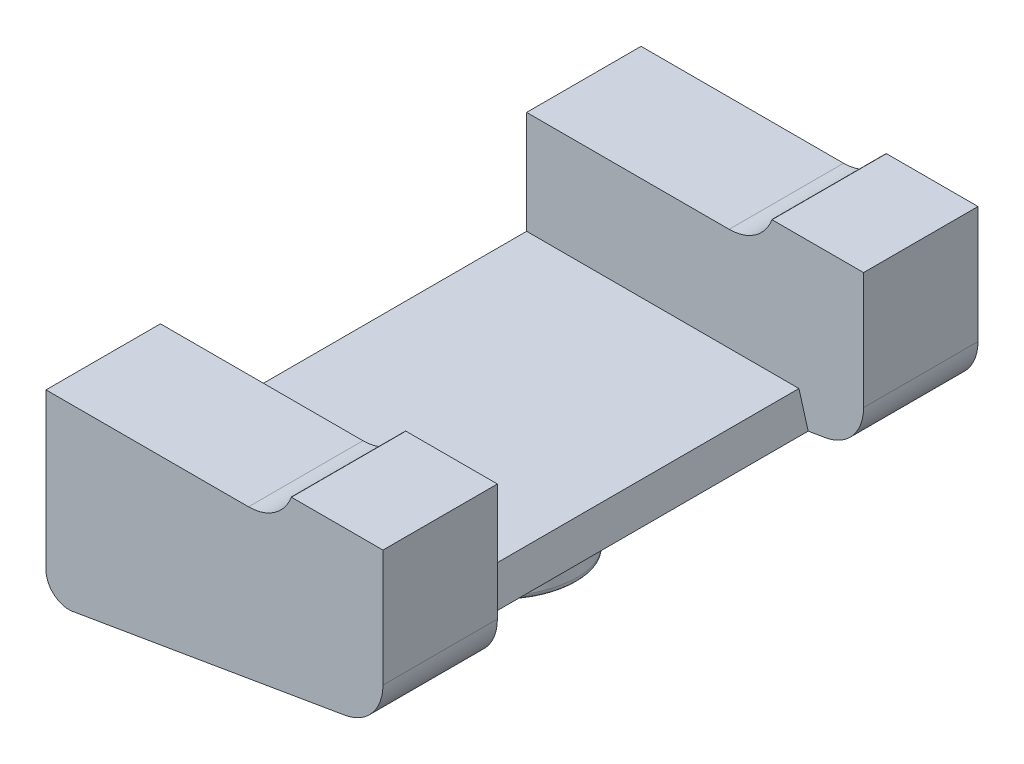
ISO-10303-21;
HEADER;
FILE_DESCRIPTION(('STEP AP214'),'2;1');
FILE_NAME('part.step','',(''),(''),'','','');
FILE_SCHEMA(('AUTOMOTIVE_DESIGN { 1 0 10303 214 1 1 1 1 }'));
ENDSEC;
DATA;
#1=APPLICATION_CONTEXT('core data for automotive mechanical design processes');
#2=APPLICATION_PROTOCOL_DEFINITION('international standard','automotive_design',2000,#1);
#3=PRODUCT_CONTEXT('',#1,'mechanical');
#4=PRODUCT('Part','Part','',(#3));
#5=PRODUCT_RELATED_PRODUCT_CATEGORY('part','',(#4));
#6=PRODUCT_DEFINITION_FORMATION('','',#4);
#7=PRODUCT_DEFINITION_CONTEXT('part definition',#1,'design');
#8=PRODUCT_DEFINITION('design','',#6,#7);
#9=PRODUCT_DEFINITION_SHAPE('','',#8);
#10=(LENGTH_UNIT() NAMED_UNIT(*) SI_UNIT(.MILLI.,.METRE.));
#11=(NAMED_UNIT(*) PLANE_ANGLE_UNIT() SI_UNIT($,.RADIAN.));
#12=(NAMED_UNIT(*) SI_UNIT($,.STERADIAN.) SOLID_ANGLE_UNIT());
#13=UNCERTAINTY_MEASURE_WITH_UNIT(LENGTH_MEASURE(1.E-05),#10,'distance_accuracy_value','');
#14=(GEOMETRIC_REPRESENTATION_CONTEXT(3) GLOBAL_UNCERTAINTY_ASSIGNED_CONTEXT((#13)) GLOBAL_UNIT_ASSIGNED_CONTEXT((#10,
#11,#12)) REPRESENTATION_CONTEXT('',''));
#15=CARTESIAN_POINT('',(0.,0.,0.));
#16=DIRECTION('',(0.,0.,1.));
#17=DIRECTION('',(1.,0.,0.));
#18=AXIS2_PLACEMENT_3D('',#15,#16,#17);
#19=CARTESIAN_POINT('',(-29.3678819048275,3.49999999999963,65.));
#20=DIRECTION('',(0.,0.,-1.));
#21=DIRECTION('',(-1.,0.,0.));
#22=AXIS2_PLACEMENT_3D('',#19,#20,#21);
#23=CYLINDRICAL_SURFACE('',#22,10.);
#24=DIRECTION('',(0.,0.,-1.));
#25=VECTOR('',#24,1.);
#26=CARTESIAN_POINT('',(-29.3678819048275,-6.50000000000037,65.));
#27=LINE('',#26,#25);
#28=CARTESIAN_POINT('',(-29.3678819048275,-6.50000000000037,-40.));
#29=VERTEX_POINT('',#28);
#30=CARTESIAN_POINT('',(-29.3678819048275,-6.50000000000037,-65.));
#31=VERTEX_POINT('',#30);
#32=EDGE_CURVE('E357',#29,#31,#27,.T.);
#33=ORIENTED_EDGE('',*,*,#32,.F.);
#34=CARTESIAN_POINT('',(-29.3678819048275,3.49999999999963,-40.));
#35=DIRECTION('',(0.,0.,-1.));
#36=DIRECTION('',(1.,0.,0.));
#37=AXIS2_PLACEMENT_3D('',#34,#35,#36);
#38=CIRCLE('',#37,10.);
#39=CARTESIAN_POINT('',(-19.9709556969684,0.0797985667430395,-40.));
#40=VERTEX_POINT('',#39);
#41=EDGE_CURVE('E224',#40,#29,#38,.T.);
#42=ORIENTED_EDGE('',*,*,#41,.F.);
#43=DIRECTION('',(0.,0.,-1.));
#44=VECTOR('',#43,1.);
#45=CARTESIAN_POINT('',(-19.9709556969684,0.0797985667430395,65.));
#46=LINE('',#45,#44);
#47=CARTESIAN_POINT('',(-19.9709556969684,0.0797985667430395,-65.));
#48=VERTEX_POINT('',#47);
#49=EDGE_CURVE('E362',#40,#48,#46,.T.);
#50=ORIENTED_EDGE('',*,*,#49,.T.);
#51=CARTESIAN_POINT('',(-29.3678819048275,3.49999999999963,-65.));
#52=DIRECTION('',(0.,0.,-1.));
#53=DIRECTION('',(1.,0.,0.));
#54=AXIS2_PLACEMENT_3D('',#51,#52,#53);
#55=CIRCLE('',#54,10.);
#56=EDGE_CURVE('E307',#48,#31,#55,.T.);
#57=ORIENTED_EDGE('',*,*,#56,.T.);
#58=EDGE_LOOP('',(#33,#42,#50,#57));
#59=FACE_BOUND('',#58,.T.);
#60=ADVANCED_FACE('F43',(#59),#23,.F.);
#61=CARTESIAN_POINT('',(-73.6121593216771,-6.50000000000037,65.));
#62=DIRECTION('',(0.,-1.,0.));
#63=DIRECTION('',(1.,0.,0.));
#64=AXIS2_PLACEMENT_3D('',#61,#62,#63);
#65=PLANE('',#64);
#66=DIRECTION('',(0.,0.,-1.));
#67=VECTOR('',#66,1.);
#68=CARTESIAN_POINT('',(-73.6121593216771,-6.50000000000037,65.));
#69=LINE('',#68,#67);
#70=CARTESIAN_POINT('',(-73.6121593216771,-6.50000000000037,-40.));
#71=VERTEX_POINT('',#70);
#72=CARTESIAN_POINT('',(-73.6121593216771,-6.50000000000037,-65.));
#73=VERTEX_POINT('',#72);
#74=EDGE_CURVE('E354',#71,#73,#69,.T.);
#75=ORIENTED_EDGE('',*,*,#74,.F.);
#76=DIRECTION('',(1.,0.,0.));
#77=VECTOR('',#76,1.);
#78=CARTESIAN_POINT('',(-73.6121593216771,-6.50000000000037,-40.));
#79=LINE('',#78,#77);
#80=EDGE_CURVE('E219',#71,#29,#79,.T.);
#81=ORIENTED_EDGE('',*,*,#80,.T.);
#82=ORIENTED_EDGE('',*,*,#32,.T.);
#83=DIRECTION('',(-1.,0.,0.));
#84=VECTOR('',#83,1.);
#85=CARTESIAN_POINT('',(-73.6121593216771,-6.50000000000037,-65.));
#86=LINE('',#85,#84);
#87=EDGE_CURVE('E311',#31,#73,#86,.T.);
#88=ORIENTED_EDGE('',*,*,#87,.T.);
#89=EDGE_LOOP('',(#75,#81,#82,#88));
#90=FACE_BOUND('',#89,.T.);
#91=ADVANCED_FACE('F419',(#90),#65,.F.);
#92=CARTESIAN_POINT('',(-21.6170031478138,-2.81853452107982,-40.));
#93=DIRECTION('',(-0.961380109587412,-0.275224063064434,0.));
#94=DIRECTION('',(0.275224063064434,-0.961380109587412,0.));
#95=AXIS2_PLACEMENT_3D('',#92,#93,#94);
#96=PLANE('',#95);
#97=DIRECTION('',(0.,0.,-1.));
#98=VECTOR('',#97,1.);
#99=CARTESIAN_POINT('',(-14.1217687090837,-29.0000000000004,-40.));
#100=LINE('',#99,#98);
#101=CARTESIAN_POINT('',(-14.1217687090837,-29.0000000000004,40.));
#102=VERTEX_POINT('',#101);
#103=CARTESIAN_POINT('',(-14.1217687090836,-29.0000000000004,-40.));
#104=VERTEX_POINT('',#103);
#105=EDGE_CURVE('E210',#102,#104,#100,.T.);
#106=ORIENTED_EDGE('',*,*,#105,.F.);
#107=DIRECTION('',(0.275224063064434,-0.961380109587412,0.));
#108=VECTOR('',#107,1.);
#109=CARTESIAN_POINT('',(-21.6170031478138,-2.81853452107982,40.));
#110=LINE('',#109,#108);
#111=CARTESIAN_POINT('',(-12.102051753186,-36.0550361286615,40.));
#112=VERTEX_POINT('',#111);
#113=EDGE_CURVE('E186',#102,#112,#110,.T.);
#114=ORIENTED_EDGE('',*,*,#113,.T.);
#115=DIRECTION('',(0.,0.,1.));
#116=VECTOR('',#115,1.);
#117=CARTESIAN_POINT('',(-12.102051753186,-36.0550361286615,-40.));
#118=LINE('',#117,#116);
#119=CARTESIAN_POINT('',(-12.102051753186,-36.0550361286615,-40.));
#120=VERTEX_POINT('',#119);
#121=EDGE_CURVE('E246',#120,#112,#118,.T.);
#122=ORIENTED_EDGE('',*,*,#121,.F.);
#123=DIRECTION('',(0.275224063064434,-0.961380109587412,0.));
#124=VECTOR('',#123,1.);
#125=CARTESIAN_POINT('',(-21.6170031478138,-2.81853452107982,-40.));
#126=LINE('',#125,#124);
#127=EDGE_CURVE('E227',#104,#120,#126,.T.);
#128=ORIENTED_EDGE('',*,*,#127,.F.);
#129=EDGE_LOOP('',(#106,#114,#122,#128));
#130=FACE_BOUND('',#129,.T.);
#131=ADVANCED_FACE('F426',(#130),#96,.F.);
#132=CARTESIAN_POINT('',(-20.,0.,65.));
#133=DIRECTION('',(0.,-1.,0.));
#134=DIRECTION('',(0.,0.,-1.));
#135=AXIS2_PLACEMENT_3D('',#132,#133,#134);
#136=PLANE('',#135);
#137=DIRECTION('',(-1.,0.,0.));
#138=VECTOR('',#137,1.);
#139=CARTESIAN_POINT('',(0.,0.,-40.));
#140=LINE('',#139,#138);
#141=CARTESIAN_POINT('',(0.,0.,-40.));
#142=VERTEX_POINT('',#141);
#143=CARTESIAN_POINT('',(-20.,0.,-40.));
#144=VERTEX_POINT('',#143);
#145=EDGE_CURVE('E240',#142,#144,#140,.T.);
#146=ORIENTED_EDGE('',*,*,#145,.F.);
#147=DIRECTION('',(0.,0.,-1.));
#148=VECTOR('',#147,1.);
#149=CARTESIAN_POINT('',(0.,0.,65.));
#150=LINE('',#149,#148);
#151=CARTESIAN_POINT('',(0.,0.,-65.));
#152=VERTEX_POINT('',#151);
#153=EDGE_CURVE('E299',#142,#152,#150,.T.);
#154=ORIENTED_EDGE('',*,*,#153,.T.);
#155=DIRECTION('',(-1.,0.,0.));
#156=VECTOR('',#155,1.);
#157=CARTESIAN_POINT('',(-20.,0.,-65.));
#158=LINE('',#157,#156);
#159=CARTESIAN_POINT('',(-20.,0.,-65.));
#160=VERTEX_POINT('',#159);
#161=EDGE_CURVE('E269',#152,#160,#158,.T.);
#162=ORIENTED_EDGE('',*,*,#161,.T.);
#163=DIRECTION('',(0.,0.,-1.));
#164=VECTOR('',#163,1.);
#165=CARTESIAN_POINT('',(-20.,0.,65.));
#166=LINE('',#165,#164);
#167=EDGE_CURVE('E367',#144,#160,#166,.T.);
#168=ORIENTED_EDGE('',*,*,#167,.F.);
#169=EDGE_LOOP('',(#146,#154,#162,#168));
#170=FACE_BOUND('',#169,.T.);
#171=ADVANCED_FACE('F443',(#170),#136,.F.);
#172=CARTESIAN_POINT('',(-19.9709556969684,0.0797985667430434,65.));
#173=DIRECTION('',(-0.939692620785902,0.342020143325687,0.));
#174=DIRECTION('',(-0.342020143325687,-0.939692620785902,0.));
#175=AXIS2_PLACEMENT_3D('',#172,#173,#174);
#176=PLANE('',#175);
#177=DIRECTION('',(0.342020143325702,0.939692620785896,0.));
#178=VECTOR('',#177,1.);
#179=CARTESIAN_POINT('',(-20.,0.,-40.));
#180=LINE('',#179,#178);
#181=EDGE_CURVE('E243',#144,#40,#180,.T.);
#182=ORIENTED_EDGE('',*,*,#181,.F.);
#183=ORIENTED_EDGE('',*,*,#167,.T.);
#184=DIRECTION('',(0.342020143325687,0.939692620785902,0.));
#185=VECTOR('',#184,1.);
#186=CARTESIAN_POINT('',(-19.9709556969684,0.0797985667430434,-65.));
#187=LINE('',#186,#185);
#188=EDGE_CURVE('E303',#160,#48,#187,.T.);
#189=ORIENTED_EDGE('',*,*,#188,.T.);
#190=ORIENTED_EDGE('',*,*,#49,.F.);
#191=EDGE_LOOP('',(#182,#183,#189,#190));
#192=FACE_BOUND('',#191,.T.);
#193=ADVANCED_FACE('F434',(#192),#176,.F.);
#194=CARTESIAN_POINT('',(-29.3678819048275,3.49999999999963,40.));
#195=DIRECTION('',(0.,0.,-1.));
#196=DIRECTION('',(1.,0.,0.));
#197=AXIS2_PLACEMENT_3D('',#194,#195,#196);
#198=CIRCLE('',#197,10.);
#199=CARTESIAN_POINT('',(-19.9709556969684,0.0797985667430395,40.));
#200=VERTEX_POINT('',#199);
#201=CARTESIAN_POINT('',(-29.3678819048275,-6.50000000000037,40.));
#202=VERTEX_POINT('',#201);
#203=EDGE_CURVE('E223',#200,#202,#198,.T.);
#204=ORIENTED_EDGE('',*,*,#203,.T.);
#205=CARTESIAN_POINT('',(-29.3678819048275,-6.50000000000037,65.));
#206=VERTEX_POINT('',#205);
#207=EDGE_CURVE('E358',#206,#202,#27,.T.);
#208=ORIENTED_EDGE('',*,*,#207,.F.);
#209=CARTESIAN_POINT('',(-29.3678819048275,3.49999999999963,65.));
#210=DIRECTION('',(0.,0.,-1.));
#211=DIRECTION('',(1.,0.,0.));
#212=AXIS2_PLACEMENT_3D('',#209,#210,#211);
#213=CIRCLE('',#212,10.);
#214=CARTESIAN_POINT('',(-19.9709556969684,0.0797985667430395,65.));
#215=VERTEX_POINT('',#214);
#216=EDGE_CURVE('E278',#215,#206,#213,.T.);
#217=ORIENTED_EDGE('',*,*,#216,.F.);
#218=EDGE_CURVE('E363',#215,#200,#46,.T.);
#219=ORIENTED_EDGE('',*,*,#218,.T.);
#220=EDGE_LOOP('',(#204,#208,#217,#219));
#221=FACE_BOUND('',#220,.T.);
#222=ADVANCED_FACE('F422',(#221),#23,.F.);
#223=CARTESIAN_POINT('',(-67.775097408949,-45.5088149215915,65.));
#224=DIRECTION('',(-0.167412382545612,0.985886958109499,0.));
#225=DIRECTION('',(-0.985886958109499,-0.167412382545612,0.));
#226=AXIS2_PLACEMENT_3D('',#223,#224,#225);
#227=PLANE('',#226);
#228=CARTESIAN_POINT('',(-36.7492257059235,-40.2403456923017,0.));
#229=DIRECTION('',(-0.167412382545612,0.985886958109499,0.));
#230=DIRECTION('',(-0.985886958109499,-0.167412382545612,0.));
#231=AXIS2_PLACEMENT_3D('',#228,#229,#230);
#232=CIRCLE('',#231,17.914213562373);
#233=CARTESIAN_POINT('',(-54.4106152218554,-43.2394068662095,0.));
#234=VERTEX_POINT('',#233);
#235=EDGE_CURVE('E384',#234,#234,#232,.T.);
#236=ORIENTED_EDGE('',*,*,#235,.T.);
#237=EDGE_LOOP('',(#236));
#238=FACE_BOUND('',#237,.T.);
#239=DIRECTION('',(0.9858869581095,0.167412382545611,0.));
#240=VECTOR('',#239,1.);
#241=CARTESIAN_POINT('',(-12.102051753186,-36.0550361286615,-40.));
#242=LINE('',#241,#240);
#243=CARTESIAN_POINT('',(-8.32587617454389,-35.413807897239,-40.));
#244=VERTEX_POINT('',#243);
#245=EDGE_CURVE('E231',#120,#244,#242,.T.);
#246=ORIENTED_EDGE('',*,*,#245,.F.);
#247=ORIENTED_EDGE('',*,*,#121,.T.);
#248=DIRECTION('',(0.9858869581095,0.167412382545611,0.));
#249=VECTOR('',#248,1.);
#250=CARTESIAN_POINT('',(-12.102051753186,-36.0550361286615,40.));
#251=LINE('',#250,#249);
#252=CARTESIAN_POINT('',(-8.32587617454389,-35.413807897239,40.));
#253=VERTEX_POINT('',#252);
#254=EDGE_CURVE('E251',#112,#253,#251,.T.);
#255=ORIENTED_EDGE('',*,*,#254,.T.);
#256=DIRECTION('',(0.,0.,-1.));
#257=VECTOR('',#256,1.);
#258=CARTESIAN_POINT('',(-8.32587617454389,-35.413807897239,65.));
#259=LINE('',#258,#257);
#260=CARTESIAN_POINT('',(-8.32587617454389,-35.413807897239,65.));
#261=VERTEX_POINT('',#260);
#262=EDGE_CURVE('E342',#261,#253,#259,.T.);
#263=ORIENTED_EDGE('',*,*,#262,.F.);
#264=DIRECTION('',(0.985886958109499,0.167412382545612,0.));
#265=VECTOR('',#264,1.);
#266=CARTESIAN_POINT('',(-67.775097408949,-45.5088149215915,65.));
#267=LINE('',#266,#265);
#268=CARTESIAN_POINT('',(-67.775097408949,-45.5088149215915,65.));
#269=VERTEX_POINT('',#268);
#270=EDGE_CURVE('E290',#269,#261,#267,.T.);
#271=ORIENTED_EDGE('',*,*,#270,.F.);
#272=DIRECTION('',(0.,0.,-1.));
#273=VECTOR('',#272,1.);
#274=CARTESIAN_POINT('',(-67.775097408949,-45.5088149215915,65.));
#275=LINE('',#274,#273);
#276=CARTESIAN_POINT('',(-67.775097408949,-45.5088149215915,-65.));
#277=VERTEX_POINT('',#276);
#278=EDGE_CURVE('E346',#269,#277,#275,.T.);
#279=ORIENTED_EDGE('',*,*,#278,.T.);
#280=DIRECTION('',(0.985886958109499,0.167412382545612,0.));
#281=VECTOR('',#280,1.);
#282=CARTESIAN_POINT('',(-67.775097408949,-45.5088149215915,-65.));
#283=LINE('',#282,#281);
#284=CARTESIAN_POINT('',(-8.32587617454389,-35.413807897239,-65.));
#285=VERTEX_POINT('',#284);
#286=EDGE_CURVE('E321',#277,#285,#283,.T.);
#287=ORIENTED_EDGE('',*,*,#286,.T.);
#288=EDGE_CURVE('E341',#244,#285,#259,.T.);
#289=ORIENTED_EDGE('',*,*,#288,.F.);
#290=EDGE_LOOP('',(#246,#247,#255,#263,#271,#279,#287,#289));
#291=FACE_BOUND('',#290,.T.);
#292=ADVANCED_FACE('F433',(#238,#291),#227,.F.);
#293=CARTESIAN_POINT('',(-10.,-25.554938316144,65.));
#294=DIRECTION('',(0.,0.,-1.));
#295=DIRECTION('',(-1.,0.,0.));
#296=AXIS2_PLACEMENT_3D('',#293,#294,#295);
#297=CYLINDRICAL_SURFACE('',#296,10.);
#298=CARTESIAN_POINT('',(-10.,-25.554938316144,-40.));
#299=DIRECTION('',(0.,0.,1.));
#300=DIRECTION('',(1.,0.,0.));
#301=AXIS2_PLACEMENT_3D('',#298,#299,#300);
#302=CIRCLE('',#301,10.);
#303=CARTESIAN_POINT('',(0.,-25.554938316144,-40.));
#304=VERTEX_POINT('',#303);
#305=EDGE_CURVE('E234',#244,#304,#302,.T.);
#306=ORIENTED_EDGE('',*,*,#305,.F.);
#307=ORIENTED_EDGE('',*,*,#288,.T.);
#308=CARTESIAN_POINT('',(-10.,-25.554938316144,-65.));
#309=DIRECTION('',(0.,0.,1.));
#310=DIRECTION('',(-1.,0.,0.));
#311=AXIS2_PLACEMENT_3D('',#308,#309,#310);
#312=CIRCLE('',#311,10.);
#313=CARTESIAN_POINT('',(0.,-25.554938316144,-65.));
#314=VERTEX_POINT('',#313);
#315=EDGE_CURVE('E325',#285,#314,#312,.T.);
#316=ORIENTED_EDGE('',*,*,#315,.T.);
#317=DIRECTION('',(0.,0.,-1.));
#318=VECTOR('',#317,1.);
#319=CARTESIAN_POINT('',(0.,-25.554938316144,65.));
#320=LINE('',#319,#318);
#321=EDGE_CURVE('E336',#304,#314,#320,.T.);
#322=ORIENTED_EDGE('',*,*,#321,.F.);
#323=EDGE_LOOP('',(#306,#307,#316,#322));
#324=FACE_BOUND('',#323,.T.);
#325=ADVANCED_FACE('F440',(#324),#297,.T.);
#326=CARTESIAN_POINT('',(0.,0.,65.));
#327=DIRECTION('',(-1.,0.,0.));
#328=DIRECTION('',(0.,-1.,0.));
#329=AXIS2_PLACEMENT_3D('',#326,#327,#328);
#330=PLANE('',#329);
#331=DIRECTION('',(0.,1.,0.));
#332=VECTOR('',#331,1.);
#333=CARTESIAN_POINT('',(0.,-25.554938316144,-40.));
#334=LINE('',#333,#332);
#335=EDGE_CURVE('E237',#304,#142,#334,.T.);
#336=ORIENTED_EDGE('',*,*,#335,.F.);
#337=ORIENTED_EDGE('',*,*,#321,.T.);
#338=DIRECTION('',(0.,1.,0.));
#339=VECTOR('',#338,1.);
#340=CARTESIAN_POINT('',(0.,0.,-65.));
#341=LINE('',#340,#339);
#342=EDGE_CURVE('E275',#314,#152,#341,.T.);
#343=ORIENTED_EDGE('',*,*,#342,.T.);
#344=ORIENTED_EDGE('',*,*,#153,.F.);
#345=EDGE_LOOP('',(#336,#337,#343,#344));
#346=FACE_BOUND('',#345,.T.);
#347=ADVANCED_FACE('F496',(#346),#330,.F.);
#348=CARTESIAN_POINT('',(0.,0.,65.));
#349=VERTEX_POINT('',#348);
#350=CARTESIAN_POINT('',(0.,0.,40.));
#351=VERTEX_POINT('',#350);
#352=EDGE_CURVE('E332',#349,#351,#150,.T.);
#353=ORIENTED_EDGE('',*,*,#352,.T.);
#354=DIRECTION('',(-1.,0.,0.));
#355=VECTOR('',#354,1.);
#356=CARTESIAN_POINT('',(0.,0.,40.));
#357=LINE('',#356,#355);
#358=CARTESIAN_POINT('',(-20.,0.,40.));
#359=VERTEX_POINT('',#358);
#360=EDGE_CURVE('E73',#351,#359,#357,.T.);
#361=ORIENTED_EDGE('',*,*,#360,.T.);
#362=CARTESIAN_POINT('',(-20.,0.,65.));
#363=VERTEX_POINT('',#362);
#364=EDGE_CURVE('E368',#363,#359,#166,.T.);
#365=ORIENTED_EDGE('',*,*,#364,.F.);
#366=DIRECTION('',(-1.,0.,0.));
#367=VECTOR('',#366,1.);
#368=CARTESIAN_POINT('',(-20.,0.,65.));
#369=LINE('',#368,#367);
#370=EDGE_CURVE('E270',#349,#363,#369,.T.);
#371=ORIENTED_EDGE('',*,*,#370,.F.);
#372=EDGE_LOOP('',(#353,#361,#365,#371));
#373=FACE_BOUND('',#372,.T.);
#374=ADVANCED_FACE('F458',(#373),#136,.F.);
#375=ORIENTED_EDGE('',*,*,#364,.T.);
#376=DIRECTION('',(0.342020143325702,0.939692620785896,0.));
#377=VECTOR('',#376,1.);
#378=CARTESIAN_POINT('',(-20.,0.,40.));
#379=LINE('',#378,#377);
#380=EDGE_CURVE('E228',#359,#200,#379,.T.);
#381=ORIENTED_EDGE('',*,*,#380,.T.);
#382=ORIENTED_EDGE('',*,*,#218,.F.);
#383=DIRECTION('',(0.342020143325687,0.939692620785902,0.));
#384=VECTOR('',#383,1.);
#385=CARTESIAN_POINT('',(-19.9709556969684,0.0797985667430434,65.));
#386=LINE('',#385,#384);
#387=EDGE_CURVE('E274',#363,#215,#386,.T.);
#388=ORIENTED_EDGE('',*,*,#387,.F.);
#389=EDGE_LOOP('',(#375,#381,#382,#388));
#390=FACE_BOUND('',#389,.T.);
#391=ADVANCED_FACE('F445',(#390),#176,.F.);
#392=ORIENTED_EDGE('',*,*,#207,.T.);
#393=DIRECTION('',(-1.,0.,0.));
#394=VECTOR('',#393,1.);
#395=CARTESIAN_POINT('',(-73.6121593216771,-6.50000000000037,40.));
#396=LINE('',#395,#394);
#397=CARTESIAN_POINT('',(-73.6121593216771,-6.50000000000037,40.));
#398=VERTEX_POINT('',#397);
#399=EDGE_CURVE('E216',#202,#398,#396,.T.);
#400=ORIENTED_EDGE('',*,*,#399,.T.);
#401=CARTESIAN_POINT('',(-73.6121593216771,-6.50000000000037,65.));
#402=VERTEX_POINT('',#401);
#403=EDGE_CURVE('E204',#402,#398,#69,.T.);
#404=ORIENTED_EDGE('',*,*,#403,.F.);
#405=DIRECTION('',(-1.,0.,0.));
#406=VECTOR('',#405,1.);
#407=CARTESIAN_POINT('',(-73.6121593216771,-6.50000000000037,65.));
#408=LINE('',#407,#406);
#409=EDGE_CURVE('E281',#206,#402,#408,.T.);
#410=ORIENTED_EDGE('',*,*,#409,.F.);
#411=EDGE_LOOP('',(#392,#400,#404,#410));
#412=FACE_BOUND('',#411,.T.);
#413=ADVANCED_FACE('F429',(#412),#65,.F.);
#414=CARTESIAN_POINT('',(-73.6121593216771,-6.50000000000037,65.));
#415=DIRECTION('',(1.,0.,0.));
#416=DIRECTION('',(0.,1.,0.));
#417=AXIS2_PLACEMENT_3D('',#414,#415,#416);
#418=PLANE('',#417);
#419=DIRECTION('',(0.,0.,1.));
#420=VECTOR('',#419,1.);
#421=CARTESIAN_POINT('',(-73.6121593216771,-29.0000000000004,-40.));
#422=LINE('',#421,#420);
#423=CARTESIAN_POINT('',(-73.6121593216771,-29.0000000000004,-40.));
#424=VERTEX_POINT('',#423);
#425=CARTESIAN_POINT('',(-73.6121593216771,-29.0000000000004,40.));
#426=VERTEX_POINT('',#425);
#427=EDGE_CURVE('E189',#424,#426,#422,.T.);
#428=ORIENTED_EDGE('',*,*,#427,.F.);
#429=DIRECTION('',(0.,1.,0.));
#430=VECTOR('',#429,1.);
#431=CARTESIAN_POINT('',(-73.6121593216771,-29.0000000000004,-40.));
#432=LINE('',#431,#430);
#433=EDGE_CURVE('E206',#424,#71,#432,.T.);
#434=ORIENTED_EDGE('',*,*,#433,.T.);
#435=ORIENTED_EDGE('',*,*,#74,.T.);
#436=DIRECTION('',(0.,-1.,0.));
#437=VECTOR('',#436,1.);
#438=CARTESIAN_POINT('',(-73.6121593216771,-6.50000000000037,-65.));
#439=LINE('',#438,#437);
#440=CARTESIAN_POINT('',(-73.6121593216771,-40.579380131044,-65.));
#441=VERTEX_POINT('',#440);
#442=EDGE_CURVE('E315',#73,#441,#439,.T.);
#443=ORIENTED_EDGE('',*,*,#442,.T.);
#444=DIRECTION('',(0.,0.,-1.));
#445=VECTOR('',#444,1.);
#446=CARTESIAN_POINT('',(-73.6121593216771,-40.579380131044,65.));
#447=LINE('',#446,#445);
#448=CARTESIAN_POINT('',(-73.6121593216771,-40.579380131044,65.));
#449=VERTEX_POINT('',#448);
#450=EDGE_CURVE('E350',#449,#441,#447,.T.);
#451=ORIENTED_EDGE('',*,*,#450,.F.);
#452=DIRECTION('',(0.,-1.,0.));
#453=VECTOR('',#452,1.);
#454=CARTESIAN_POINT('',(-73.6121593216771,-6.50000000000037,65.));
#455=LINE('',#454,#453);
#456=EDGE_CURVE('E284',#402,#449,#455,.T.);
#457=ORIENTED_EDGE('',*,*,#456,.F.);
#458=ORIENTED_EDGE('',*,*,#403,.T.);
#459=DIRECTION('',(0.,1.,0.));
#460=VECTOR('',#459,1.);
#461=CARTESIAN_POINT('',(-73.6121593216771,-29.0000000000004,40.));
#462=LINE('',#461,#460);
#463=EDGE_CURVE('E183',#426,#398,#462,.T.);
#464=ORIENTED_EDGE('',*,*,#463,.F.);
#465=EDGE_LOOP('',(#428,#434,#435,#443,#451,#457,#458,#464));
#466=FACE_BOUND('',#465,.T.);
#467=ADVANCED_FACE('F201',(#466),#418,.F.);
#468=CARTESIAN_POINT('',(-68.6121593216771,-40.579380131044,65.));
#469=DIRECTION('',(0.,0.,-1.));
#470=DIRECTION('',(-1.,0.,0.));
#471=AXIS2_PLACEMENT_3D('',#468,#469,#470);
#472=CYLINDRICAL_SURFACE('',#471,5.00000000000001);
#473=CARTESIAN_POINT('',(-68.6121593216771,-40.579380131044,-65.));
#474=DIRECTION('',(0.,0.,1.));
#475=DIRECTION('',(-1.,0.,0.));
#476=AXIS2_PLACEMENT_3D('',#473,#474,#475);
#477=CIRCLE('',#476,5.00000000000001);
#478=EDGE_CURVE('E318',#441,#277,#477,.T.);
#479=ORIENTED_EDGE('',*,*,#478,.T.);
#480=ORIENTED_EDGE('',*,*,#278,.F.);
#481=CARTESIAN_POINT('',(-68.6121593216771,-40.579380131044,65.));
#482=DIRECTION('',(0.,0.,1.));
#483=DIRECTION('',(-1.,0.,0.));
#484=AXIS2_PLACEMENT_3D('',#481,#482,#483);
#485=CIRCLE('',#484,5.00000000000001);
#486=EDGE_CURVE('E287',#449,#269,#485,.T.);
#487=ORIENTED_EDGE('',*,*,#486,.F.);
#488=ORIENTED_EDGE('',*,*,#450,.T.);
#489=EDGE_LOOP('',(#479,#480,#487,#488));
#490=FACE_BOUND('',#489,.T.);
#491=ADVANCED_FACE('F528',(#490),#472,.T.);
#492=ORIENTED_EDGE('',*,*,#262,.T.);
#493=CARTESIAN_POINT('',(-10.,-25.554938316144,40.));
#494=DIRECTION('',(0.,0.,1.));
#495=DIRECTION('',(1.,0.,0.));
#496=AXIS2_PLACEMENT_3D('',#493,#494,#495);
#497=CIRCLE('',#496,10.);
#498=CARTESIAN_POINT('',(0.,-25.554938316144,40.));
#499=VERTEX_POINT('',#498);
#500=EDGE_CURVE('E255',#253,#499,#497,.T.);
#501=ORIENTED_EDGE('',*,*,#500,.T.);
#502=CARTESIAN_POINT('',(0.,-25.554938316144,65.));
#503=VERTEX_POINT('',#502);
#504=EDGE_CURVE('E337',#503,#499,#320,.T.);
#505=ORIENTED_EDGE('',*,*,#504,.F.);
#506=CARTESIAN_POINT('',(-10.,-25.554938316144,65.));
#507=DIRECTION('',(0.,0.,1.));
#508=DIRECTION('',(-1.,0.,0.));
#509=AXIS2_PLACEMENT_3D('',#506,#507,#508);
#510=CIRCLE('',#509,10.);
#511=EDGE_CURVE('E293',#261,#503,#510,.T.);
#512=ORIENTED_EDGE('',*,*,#511,.F.);
#513=EDGE_LOOP('',(#492,#501,#505,#512));
#514=FACE_BOUND('',#513,.T.);
#515=ADVANCED_FACE('F471',(#514),#297,.T.);
#516=ORIENTED_EDGE('',*,*,#504,.T.);
#517=DIRECTION('',(0.,1.,0.));
#518=VECTOR('',#517,1.);
#519=CARTESIAN_POINT('',(0.,-25.554938316144,40.));
#520=LINE('',#519,#518);
#521=EDGE_CURVE('E258',#499,#351,#520,.T.);
#522=ORIENTED_EDGE('',*,*,#521,.T.);
#523=ORIENTED_EDGE('',*,*,#352,.F.);
#524=DIRECTION('',(0.,1.,0.));
#525=VECTOR('',#524,1.);
#526=CARTESIAN_POINT('',(0.,0.,65.));
#527=LINE('',#526,#525);
#528=EDGE_CURVE('E296',#503,#349,#527,.T.);
#529=ORIENTED_EDGE('',*,*,#528,.F.);
#530=EDGE_LOOP('',(#516,#522,#523,#529));
#531=FACE_BOUND('',#530,.T.);
#532=ADVANCED_FACE('F462',(#531),#330,.F.);
#533=CARTESIAN_POINT('',(-10.,-25.554938316144,65.));
#534=DIRECTION('',(0.,0.,-1.));
#535=DIRECTION('',(-1.,0.,0.));
#536=AXIS2_PLACEMENT_3D('',#533,#534,#535);
#537=PLANE('',#536);
#538=ORIENTED_EDGE('',*,*,#370,.T.);
#539=ORIENTED_EDGE('',*,*,#387,.T.);
#540=ORIENTED_EDGE('',*,*,#216,.T.);
#541=ORIENTED_EDGE('',*,*,#409,.T.);
#542=ORIENTED_EDGE('',*,*,#456,.T.);
#543=ORIENTED_EDGE('',*,*,#486,.T.);
#544=ORIENTED_EDGE('',*,*,#270,.T.);
#545=ORIENTED_EDGE('',*,*,#511,.T.);
#546=ORIENTED_EDGE('',*,*,#528,.T.);
#547=EDGE_LOOP('',(#538,#539,#540,#541,#542,#543,#544,#545,#546));
#548=FACE_BOUND('',#547,.T.);
#549=ADVANCED_FACE('F452',(#548),#537,.F.);
#550=CARTESIAN_POINT('',(-10.,-25.554938316144,-65.));
#551=DIRECTION('',(0.,0.,-1.));
#552=DIRECTION('',(-1.,0.,0.));
#553=AXIS2_PLACEMENT_3D('',#550,#551,#552);
#554=PLANE('',#553);
#555=ORIENTED_EDGE('',*,*,#161,.F.);
#556=ORIENTED_EDGE('',*,*,#342,.F.);
#557=ORIENTED_EDGE('',*,*,#315,.F.);
#558=ORIENTED_EDGE('',*,*,#286,.F.);
#559=ORIENTED_EDGE('',*,*,#478,.F.);
#560=ORIENTED_EDGE('',*,*,#442,.F.);
#561=ORIENTED_EDGE('',*,*,#87,.F.);
#562=ORIENTED_EDGE('',*,*,#56,.F.);
#563=ORIENTED_EDGE('',*,*,#188,.F.);
#564=EDGE_LOOP('',(#555,#556,#557,#558,#559,#560,#561,#562,#563));
#565=FACE_BOUND('',#564,.T.);
#566=ADVANCED_FACE('F481',(#565),#554,.T.);
#567=CARTESIAN_POINT('',(-29.3678819048275,3.49999999999963,-40.));
#568=DIRECTION('',(0.,0.,1.));
#569=DIRECTION('',(1.,0.,0.));
#570=AXIS2_PLACEMENT_3D('',#567,#568,#569);
#571=PLANE('',#570);
#572=ORIENTED_EDGE('',*,*,#41,.T.);
#573=ORIENTED_EDGE('',*,*,#80,.F.);
#574=ORIENTED_EDGE('',*,*,#433,.F.);
#575=DIRECTION('',(-1.,0.,0.));
#576=VECTOR('',#575,1.);
#577=CARTESIAN_POINT('',(0.,-29.0000000000004,-40.));
#578=LINE('',#577,#576);
#579=EDGE_CURVE('E188',#104,#424,#578,.T.);
#580=ORIENTED_EDGE('',*,*,#579,.F.);
#581=ORIENTED_EDGE('',*,*,#127,.T.);
#582=ORIENTED_EDGE('',*,*,#245,.T.);
#583=ORIENTED_EDGE('',*,*,#305,.T.);
#584=ORIENTED_EDGE('',*,*,#335,.T.);
#585=ORIENTED_EDGE('',*,*,#145,.T.);
#586=ORIENTED_EDGE('',*,*,#181,.T.);
#587=EDGE_LOOP('',(#572,#573,#574,#580,#581,#582,#583,#584,#585,#586));
#588=FACE_BOUND('',#587,.T.);
#589=ADVANCED_FACE('F509',(#588),#571,.T.);
#590=CARTESIAN_POINT('',(-29.3678819048275,3.49999999999963,40.));
#591=DIRECTION('',(0.,0.,1.));
#592=DIRECTION('',(1.,0.,0.));
#593=AXIS2_PLACEMENT_3D('',#590,#591,#592);
#594=PLANE('',#593);
#595=ORIENTED_EDGE('',*,*,#521,.F.);
#596=ORIENTED_EDGE('',*,*,#500,.F.);
#597=ORIENTED_EDGE('',*,*,#254,.F.);
#598=ORIENTED_EDGE('',*,*,#113,.F.);
#599=DIRECTION('',(1.,0.,0.));
#600=VECTOR('',#599,1.);
#601=CARTESIAN_POINT('',(-73.6121593216771,-29.0000000000004,40.));
#602=LINE('',#601,#600);
#603=EDGE_CURVE('E65',#426,#102,#602,.T.);
#604=ORIENTED_EDGE('',*,*,#603,.F.);
#605=ORIENTED_EDGE('',*,*,#463,.T.);
#606=ORIENTED_EDGE('',*,*,#399,.F.);
#607=ORIENTED_EDGE('',*,*,#203,.F.);
#608=ORIENTED_EDGE('',*,*,#380,.F.);
#609=ORIENTED_EDGE('',*,*,#360,.F.);
#610=EDGE_LOOP('',(#595,#596,#597,#598,#604,#605,#606,#607,#608,#609));
#611=FACE_BOUND('',#610,.T.);
#612=ADVANCED_FACE('F180',(#611),#594,.F.);
#613=CARTESIAN_POINT('',(0.,-29.0000000000004,0.));
#614=DIRECTION('',(0.,1.,0.));
#615=DIRECTION('',(-1.,0.,0.));
#616=AXIS2_PLACEMENT_3D('',#613,#614,#615);
#617=PLANE('',#616);
#618=ORIENTED_EDGE('',*,*,#105,.T.);
#619=ORIENTED_EDGE('',*,*,#579,.T.);
#620=ORIENTED_EDGE('',*,*,#427,.T.);
#621=ORIENTED_EDGE('',*,*,#603,.T.);
#622=EDGE_LOOP('',(#618,#619,#620,#621));
#623=FACE_BOUND('',#622,.T.);
#624=ADVANCED_FACE('F192',(#623),#617,.T.);
#625=CARTESIAN_POINT('',(-34.7402771153761,-52.0709891896158,0.));
#626=DIRECTION('',(0.167412382545612,-0.9858869581095,0.));
#627=DIRECTION('',(0.9858869581095,0.167412382545612,0.));
#628=AXIS2_PLACEMENT_3D('',#625,#626,#627);
#629=PLANE('',#628);
#630=CARTESIAN_POINT('',(-34.7402771153761,-52.0709891896158,0.));
#631=DIRECTION('',(0.167412382545612,-0.9858869581095,0.));
#632=DIRECTION('',(0.9858869581095,0.167412382545612,0.));
#633=AXIS2_PLACEMENT_3D('',#630,#631,#632);
#634=CIRCLE('',#633,11.5);
#635=CARTESIAN_POINT('',(-23.4025770971169,-50.1457467903412,0.));
#636=VERTEX_POINT('',#635);
#637=EDGE_CURVE('E372',#636,#636,#634,.T.);
#638=ORIENTED_EDGE('',*,*,#637,.T.);
#639=EDGE_LOOP('',(#638));
#640=FACE_BOUND('',#639,.T.);
#641=CARTESIAN_POINT('',(-34.7402771153761,-52.0709891896158,0.));
#642=DIRECTION('',(0.167412382545612,-0.9858869581095,0.));
#643=DIRECTION('',(0.9858869581095,0.167412382545612,0.));
#644=AXIS2_PLACEMENT_3D('',#641,#642,#643);
#645=CIRCLE('',#644,5.);
#646=CARTESIAN_POINT('',(-29.8108423248286,-51.2339272768877,0.));
#647=VERTEX_POINT('',#646);
#648=EDGE_CURVE('E198',#647,#647,#645,.T.);
#649=ORIENTED_EDGE('',*,*,#648,.F.);
#650=EDGE_LOOP('',(#649));
#651=FACE_BOUND('',#650,.T.);
#652=ADVANCED_FACE('F403',(#640,#651),#629,.T.);
#653=CARTESIAN_POINT('',(-34.7402771153761,-52.0709891896158,0.));
#654=DIRECTION('',(-0.167412382545612,0.985886958109499,0.));
#655=DIRECTION('',(-0.985886958109499,-0.167412382545612,0.));
#656=AXIS2_PLACEMENT_3D('',#653,#654,#655);
#657=CYLINDRICAL_SURFACE('',#656,12.5);
#658=CARTESIAN_POINT('',(-33.9076894979217,-48.5493145537852,-12.4201749523354));
#659=CARTESIAN_POINT('',(-33.9076919353119,-48.4934608425855,-12.4191137310426));
#660=CARTESIAN_POINT('',(-33.9123847733174,-48.437559674092,-12.418568029388));
#661=CARTESIAN_POINT('',(-33.9310441501286,-48.3272836897955,-12.418560366516));
#662=CARTESIAN_POINT('',(-33.945020870758,-48.2729106182051,-12.4190995964843));
#663=CARTESIAN_POINT('',(-33.9818423859027,-48.167305013574,-12.421214457085));
#664=CARTESIAN_POINT('',(-34.0046824136401,-48.1160708095383,-12.4227895309456));
#665=CARTESIAN_POINT('',(-34.0585669074677,-48.0181716521383,-12.426836670415));
#666=CARTESIAN_POINT('',(-34.0896097055819,-47.9715057724779,-12.4293085537018));
#667=CARTESIAN_POINT('',(-34.1591013050585,-47.883921242852,-12.4349429681747));
#668=CARTESIAN_POINT('',(-34.1975679834253,-47.8430168866869,-12.4381071689994));
#669=CARTESIAN_POINT('',(-34.2807740315322,-47.7682211788942,-12.4448565464684));
#670=CARTESIAN_POINT('',(-34.325513820551,-47.7343302964044,-12.448441751249));
#671=CARTESIAN_POINT('',(-34.4202844982219,-47.6743292039367,-12.4557632691775));
#672=CARTESIAN_POINT('',(-34.4703438509589,-47.6482640325084,-12.4595003215831));
#673=CARTESIAN_POINT('',(-34.574138879599,-47.6049060676141,-12.4668155544706));
#674=CARTESIAN_POINT('',(-34.6278745928573,-47.5876133632995,-12.4703937333375));
#675=CARTESIAN_POINT('',(-34.7376021978327,-47.5622756349679,-12.477138320561));
#676=CARTESIAN_POINT('',(-34.7935976045871,-47.554245642278,-12.4803040522448));
#677=CARTESIAN_POINT('',(-34.9061724708325,-47.5477276167478,-12.4860142001627));
#678=CARTESIAN_POINT('',(-34.9627519171489,-47.5492393691363,-12.4885586303802));
#679=CARTESIAN_POINT('',(-35.074689287956,-47.5617558660901,-12.4928920853072));
#680=CARTESIAN_POINT('',(-35.1300506546197,-47.5727289607459,-12.4946835989715));
#681=CARTESIAN_POINT('',(-35.2381618446299,-47.6038244153516,-12.4974828499259));
#682=CARTESIAN_POINT('',(-35.2909117147224,-47.6239466114665,-12.4984906012501));
#683=CARTESIAN_POINT('',(-35.3921270411627,-47.6726928812939,-12.4997652320693));
#684=CARTESIAN_POINT('',(-35.4406055533112,-47.7012897924822,-12.5000344507984));
#685=CARTESIAN_POINT('',(-35.5320883748174,-47.7661979516528,-12.4999584322678));
#686=CARTESIAN_POINT('',(-35.5750926659569,-47.8025092253075,-12.4996131929632));
#687=CARTESIAN_POINT('',(-35.6544286169461,-47.8818350479132,-12.4984848796838));
#688=CARTESIAN_POINT('',(-35.6907571746725,-47.9248526961507,-12.4977016028389));
#689=CARTESIAN_POINT('',(-35.7556931055302,-48.0163627147061,-12.4959076097915));
#690=CARTESIAN_POINT('',(-35.7843003878478,-48.0648551494061,-12.4948968909142));
#691=CARTESIAN_POINT('',(-35.833035562881,-48.166046383022,-12.4928629692743));
#692=CARTESIAN_POINT('',(-35.8531466936573,-48.2187532552861,-12.491839745894));
#693=CARTESIAN_POINT('',(-35.8842377192188,-48.3267979401442,-12.4899801816379));
#694=CARTESIAN_POINT('',(-35.8952176191265,-48.3821357512624,-12.4891438406573));
#695=CARTESIAN_POINT('',(-35.9077341381624,-48.49388491516,-12.4878099366665));
#696=CARTESIAN_POINT('',(-35.9092688540052,-48.5502964820133,-12.4873124419546));
#697=CARTESIAN_POINT('',(-35.9028444505796,-48.6625784145201,-12.4867442600645));
#698=CARTESIAN_POINT('',(-35.8948853933814,-48.7184487837094,-12.4866735700958));
#699=CARTESIAN_POINT('',(-35.8697122268279,-48.8280047955129,-12.486971167011));
#700=CARTESIAN_POINT('',(-35.8525072100707,-48.8816925288594,-12.4873390230551));
#701=CARTESIAN_POINT('',(-35.8093375728209,-48.9854182618114,-12.4884485757689));
#702=CARTESIAN_POINT('',(-35.7833729220337,-49.0354562487939,-12.4891902737315));
#703=CARTESIAN_POINT('',(-35.7234146077606,-49.130476551012,-12.4909147319856));
#704=CARTESIAN_POINT('',(-35.6894190891047,-49.1754576945431,-12.4918975479786));
#705=CARTESIAN_POINT('',(-35.6143648980497,-49.2590795617566,-12.4939190772595));
#706=CARTESIAN_POINT('',(-35.5733061679119,-49.2977202336034,-12.4949577910042));
#707=CARTESIAN_POINT('',(-35.4852451956373,-49.367600441188,-12.4968778682041));
#708=CARTESIAN_POINT('',(-35.4382374909877,-49.3988330979469,-12.4977590852244));
#709=CARTESIAN_POINT('',(-35.3396406118544,-49.452963277464,-12.4991458814084));
#710=CARTESIAN_POINT('',(-35.288051472446,-49.4758608640286,-12.4996514634478));
#711=CARTESIAN_POINT('',(-35.1818019834784,-49.5126526800406,-12.5000950350702));
#712=CARTESIAN_POINT('',(-35.1271442116814,-49.526554346955,-12.5000334941711));
#713=CARTESIAN_POINT('',(-35.016276419703,-49.5449885157892,-12.499203321511));
#714=CARTESIAN_POINT('',(-34.9600664217718,-49.5495211519378,-12.4984346998804));
#715=CARTESIAN_POINT('',(-34.8478098013841,-49.54909388568,-12.4961229806607));
#716=CARTESIAN_POINT('',(-34.7917630751639,-49.5441526562859,-12.4945814109762));
#717=CARTESIAN_POINT('',(-34.6813128828133,-49.5249658905529,-12.4907379012249));
#718=CARTESIAN_POINT('',(-34.626909421956,-49.5107203243606,-12.4884359587184));
#719=CARTESIAN_POINT('',(-34.5212518744269,-49.4733319565605,-12.4831686447673));
#720=CARTESIAN_POINT('',(-34.469999559726,-49.4501842011475,-12.4802029043235));
#721=CARTESIAN_POINT('',(-34.3721137560542,-49.3956580920444,-12.4737854298306));
#722=CARTESIAN_POINT('',(-34.3254802196179,-49.3642798229484,-12.4703337007766));
#723=CARTESIAN_POINT('',(-34.2379665140602,-49.2940497861482,-12.463169970818));
#724=CARTESIAN_POINT('',(-34.1971081728293,-49.2551709124333,-12.4594570579345));
#725=CARTESIAN_POINT('',(-34.1224833736971,-49.171095158488,-12.4520637735553));
#726=CARTESIAN_POINT('',(-34.0887187121845,-49.1258966827097,-12.4483834105279));
#727=CARTESIAN_POINT('',(-34.0291620249167,-49.0303238837364,-12.441342977216));
#728=CARTESIAN_POINT('',(-34.0033928209672,-48.9799352816163,-12.4379838423688));
#729=CARTESIAN_POINT('',(-33.9607225036626,-48.87554442676,-12.431884891243));
#730=CARTESIAN_POINT('',(-33.9438111246754,-48.821546439304,-12.42914436015));
#731=CARTESIAN_POINT('',(-33.9236380530747,-48.7309117118082,-12.4253337474489));
#732=CARTESIAN_POINT('',(-33.9176661048321,-48.6948657478034,-12.4240153735112));
#733=CARTESIAN_POINT('',(-33.9096910358869,-48.6223248008935,-12.4217828717782));
#734=CARTESIAN_POINT('',(-33.9076879044386,-48.5858298192044,-12.4208687428883));
#735=CARTESIAN_POINT('',(-33.9076894979217,-48.5493145537852,-12.4201749523354));
#736=B_SPLINE_CURVE_WITH_KNOTS('',3,(#658,#659,#660,#661,#662,#663,#664,#665,#666,#667,#668,
#669,#670,#671,#672,#673,#674,#675,#676,#677,#678,#679,#680,#681,#682,#683,#684,#685,#686,#687,
#688,#689,#690,#691,#692,#693,#694,#695,#696,#697,#698,#699,#700,#701,#702,#703,#704,#705,#706,
#707,#708,#709,#710,#711,#712,#713,#714,#715,#716,#717,#718,#719,#720,#721,#722,#723,#724,#725,
#726,#727,#728,#729,#730,#731,#732,#733,#734,#735),.UNSPECIFIED.,.T.,.F.,(4,2,2,2,2,2,2,2,2,2,2,
2,2,2,2,2,2,2,2,2,2,2,2,2,2,2,2,2,2,2,2,2,2,2,2,2,2,2,4),(0.,0.167458289614297,
0.335100538056778,0.502652751443316,0.670170920439585,0.838097629936482,1.00603556858036,
1.17492227157801,1.34381069087449,1.51297279476541,1.68213109107054,1.85072570786378,
2.01931730571484,2.18737428521336,2.35543182399142,2.52356726044295,2.69170467432999,
2.86017227235428,3.02863977587184,3.19714122592236,3.36564157432,3.53397651968424,
3.70231204722634,3.87068649919522,4.03906232761539,4.20759390066032,4.37612418354258,
4.54451495369922,4.71290331132526,4.88096011623998,5.04901746037251,5.21716845908137,
5.3853177295827,5.55408645046217,5.72289785860096,5.89218677201975,6.0612790542592,
6.17075791102127,6.28023647136369),.UNSPECIFIED.);
#737=CARTESIAN_POINT('',(-33.9076894979217,-48.5493145537852,-12.4201749523354));
#738=VERTEX_POINT('',#737);
#739=EDGE_CURVE('E749',#738,#738,#736,.T.);
#740=ORIENTED_EDGE('',*,*,#739,.T.);
#741=EDGE_LOOP('',(#740));
#742=FACE_BOUND('',#741,.T.);
#743=CARTESIAN_POINT('',(-34.9076894979217,-51.0851022315063,0.));
#744=DIRECTION('',(0.167412382545612,-0.9858869581095,0.));
#745=DIRECTION('',(0.9858869581095,0.167412382545612,0.));
#746=AXIS2_PLACEMENT_3D('',#743,#744,#745);
#747=CIRCLE('',#746,12.5);
#748=CARTESIAN_POINT('',(-22.584102521553,-48.9924474496861,0.));
#749=VERTEX_POINT('',#748);
#750=EDGE_CURVE('E380',#749,#749,#747,.F.);
#751=ORIENTED_EDGE('',*,*,#750,.T.);
#752=EDGE_LOOP('',(#751));
#753=FACE_BOUND('',#752,.T.);
#754=CARTESIAN_POINT('',(-35.8428193138358,-45.578148231865,0.));
#755=DIRECTION('',(0.167412382545612,-0.985886958109499,0.));
#756=DIRECTION('',(0.985886958109499,0.167412382545612,0.));
#757=AXIS2_PLACEMENT_3D('',#754,#755,#756);
#758=CIRCLE('',#757,12.5);
#759=CARTESIAN_POINT('',(-23.5192323374671,-43.4854934500448,0.));
#760=VERTEX_POINT('',#759);
#761=EDGE_CURVE('E376',#760,#760,#758,.T.);
#762=ORIENTED_EDGE('',*,*,#761,.T.);
#763=EDGE_LOOP('',(#762));
#764=FACE_BOUND('',#763,.T.);
#765=ADVANCED_FACE('F400',(#742,#753,#764),#657,.T.);
#766=CARTESIAN_POINT('',(-34.7402771153761,-52.0709891896158,0.));
#767=DIRECTION('',(-0.167412382545612,0.985886958109499,0.));
#768=DIRECTION('',(-0.985886958109499,-0.167412382545612,0.));
#769=AXIS2_PLACEMENT_3D('',#766,#767,#768);
#770=CYLINDRICAL_SURFACE('',#769,5.);
#771=CARTESIAN_POINT('',(-33.9076894979217,-48.5493145537852,-4.7969517244412));
#772=CARTESIAN_POINT('',(-33.9076912768251,-48.4951549525423,-4.79428698092739));
#773=CARTESIAN_POINT('',(-33.9121046703395,-48.4409123758109,-4.79287424090926));
#774=CARTESIAN_POINT('',(-33.9296731608487,-48.3338364366041,-4.79269411860002));
#775=CARTESIAN_POINT('',(-33.9428330205333,-48.2810038582236,-4.79392817837949));
#776=CARTESIAN_POINT('',(-33.9774761334808,-48.1783207076959,-4.79892246967157));
#777=CARTESIAN_POINT('',(-33.9989525038734,-48.1284677088851,-4.80268061409745));
#778=CARTESIAN_POINT('',(-34.0495575106518,-48.0330520118304,-4.81237311438078));
#779=CARTESIAN_POINT('',(-34.0786863437825,-47.9874894239338,-4.81830752619163));
#780=CARTESIAN_POINT('',(-34.1441968895063,-47.9011984389203,-4.83193004714865));
#781=CARTESIAN_POINT('',(-34.1806740952563,-47.8605463302208,-4.83964146158367));
#782=CARTESIAN_POINT('',(-34.2596152018633,-47.7857989479957,-4.85613040781807));
#783=CARTESIAN_POINT('',(-34.3020802768322,-47.7517049635056,-4.86490814865775));
#784=CARTESIAN_POINT('',(-34.3935700689971,-47.6897543652559,-4.88318462578269));
#785=CARTESIAN_POINT('',(-34.4427785200904,-47.662173068694,-4.89269800417699));
#786=CARTESIAN_POINT('',(-34.5451789908376,-47.6156392753349,-4.9114140644814));
#787=CARTESIAN_POINT('',(-34.598371397914,-47.5966876190048,-4.92061671604812));
#788=CARTESIAN_POINT('',(-34.7080172437907,-47.5677932824378,-4.93816320822395));
#789=CARTESIAN_POINT('',(-34.7645029263279,-47.5579651582494,-4.94649499251995));
#790=CARTESIAN_POINT('',(-34.8785272160738,-47.5481038189698,-4.9616145598945));
#791=CARTESIAN_POINT('',(-34.936065680369,-47.5480692841357,-4.96840255088493));
#792=CARTESIAN_POINT('',(-35.049359516125,-47.5578015406497,-4.97995182442956));
#793=CARTESIAN_POINT('',(-35.1051276656488,-47.5673748810341,-4.98475046667904));
#794=CARTESIAN_POINT('',(-35.2143748056805,-47.5958319155858,-4.99237122196291));
#795=CARTESIAN_POINT('',(-35.2678540813217,-47.614714446383,-4.99519358186672));
#796=CARTESIAN_POINT('',(-35.3698352636242,-47.6607835534956,-4.9989032593352));
#797=CARTESIAN_POINT('',(-35.4184174633863,-47.687789562656,-4.99982953945029));
#798=CARTESIAN_POINT('',(-35.5104462520409,-47.7494690927712,-5.00012721769887));
#799=CARTESIAN_POINT('',(-35.5538927850261,-47.7841426971844,-4.99949859890723));
#800=CARTESIAN_POINT('',(-35.6344821152506,-47.860222936417,-4.99709183276991));
#801=CARTESIAN_POINT('',(-35.6716172466931,-47.9016376411531,-4.99531229995311));
#802=CARTESIAN_POINT('',(-35.7385098121451,-47.9900206235058,-4.99109938681208));
#803=CARTESIAN_POINT('',(-35.7682667133915,-48.0369893017992,-4.98866595929819));
#804=CARTESIAN_POINT('',(-35.8199131033189,-48.1358008868268,-4.98363825635646));
#805=CARTESIAN_POINT('',(-35.8417017017176,-48.1876964758803,-4.98104237512999));
#806=CARTESIAN_POINT('',(-35.8762840061208,-48.294420101831,-4.97622381454103));
#807=CARTESIAN_POINT('',(-35.8890776567598,-48.3492481567757,-4.97400113747574));
#808=CARTESIAN_POINT('',(-35.9053202091744,-48.4604443985724,-4.97033260567594));
#809=CARTESIAN_POINT('',(-35.9087448874204,-48.5168161978699,-4.96888877236038));
#810=CARTESIAN_POINT('',(-35.9060690966684,-48.6293495040509,-4.96704625561385));
#811=CARTESIAN_POINT('',(-35.8999690501521,-48.6855110201509,-4.96664752582803));
#812=CARTESIAN_POINT('',(-35.878483849199,-48.7956634683014,-4.96696486485125));
#813=CARTESIAN_POINT('',(-35.8631563445619,-48.8496656751154,-4.96767405530041));
#814=CARTESIAN_POINT('',(-35.8237071731355,-48.9543326155543,-4.97006951741761));
#815=CARTESIAN_POINT('',(-35.7995853709173,-49.0049972977685,-4.97175580413277));
#816=CARTESIAN_POINT('',(-35.7432263671689,-49.1015882184613,-4.97580549108515));
#817=CARTESIAN_POINT('',(-35.710985739346,-49.1475124448154,-4.97816917725558));
#818=CARTESIAN_POINT('',(-35.6392977661574,-49.2333288707194,-4.98313656493137));
#819=CARTESIAN_POINT('',(-35.5998500489919,-49.2732207588787,-4.98574027881585));
#820=CARTESIAN_POINT('',(-35.5145766302569,-49.3460908372764,-4.99068492937888));
#821=CARTESIAN_POINT('',(-35.4687133394784,-49.3790251795728,-4.99302415866911));
#822=CARTESIAN_POINT('',(-35.3720782001128,-49.4367320872052,-4.99687430066652));
#823=CARTESIAN_POINT('',(-35.3213065025267,-49.4615049035171,-4.99838523884553));
#824=CARTESIAN_POINT('',(-35.2164918294165,-49.502093465829,-5.00007641858051));
#825=CARTESIAN_POINT('',(-35.1624615682593,-49.517941810662,-5.00026153247238));
#826=CARTESIAN_POINT('',(-35.0525310535313,-49.5403579197629,-4.99893201654392));
#827=CARTESIAN_POINT('',(-34.996630985609,-49.5469266026023,-4.99741755498712));
#828=CARTESIAN_POINT('',(-34.8852954916506,-49.5505951730137,-4.99250646247002));
#829=CARTESIAN_POINT('',(-34.8298627983841,-49.547810438312,-4.9891331917908));
#830=CARTESIAN_POINT('',(-34.7203626235193,-49.5331641442565,-4.98051086495943));
#831=CARTESIAN_POINT('',(-34.6662951345922,-49.5213026336401,-4.97526181887927));
#832=CARTESIAN_POINT('',(-34.5609896582537,-49.4889083347274,-4.96307436457594));
#833=CARTESIAN_POINT('',(-34.5097536340567,-49.4683696132563,-4.95613480181352));
#834=CARTESIAN_POINT('',(-34.4114995781955,-49.4192645483467,-4.94094033621134));
#835=CARTESIAN_POINT('',(-34.3644819974533,-49.3906973480656,-4.93268529301715));
#836=CARTESIAN_POINT('',(-34.2748860749221,-49.3256461093251,-4.91518925100627));
#837=CARTESIAN_POINT('',(-34.2324259011273,-49.2890040404955,-4.90593077360715));
#838=CARTESIAN_POINT('',(-34.1542168341265,-49.2091652409102,-4.88723980187895));
#839=CARTESIAN_POINT('',(-34.1184700381978,-49.1659664694186,-4.87780725417721));
#840=CARTESIAN_POINT('',(-34.0540210260818,-49.0732416231291,-4.8593191835741));
#841=CARTESIAN_POINT('',(-34.0254680285809,-49.023609554034,-4.85027444576456));
#842=CARTESIAN_POINT('',(-33.9771939426651,-48.9200384864679,-4.83354774760079));
#843=CARTESIAN_POINT('',(-33.9574651373833,-48.8661032999669,-4.82586460008357));
#844=CARTESIAN_POINT('',(-33.9309790043552,-48.7683415100618,-4.81412063966135));
#845=CARTESIAN_POINT('',(-33.9222710951322,-48.7250848524919,-4.8096329414088));
#846=CARTESIAN_POINT('',(-33.9106259290588,-48.6376753440941,-4.80213611893563));
#847=CARTESIAN_POINT('',(-33.9076880458832,-48.5935225910612,-4.79912683426266));
#848=CARTESIAN_POINT('',(-33.9076894979217,-48.5493145537852,-4.7969517244412));
#849=B_SPLINE_CURVE_WITH_KNOTS('',3,(#771,#772,#773,#774,#775,#776,#777,#778,#779,#780,#781,
#782,#783,#784,#785,#786,#787,#788,#789,#790,#791,#792,#793,#794,#795,#796,#797,#798,#799,#800,
#801,#802,#803,#804,#805,#806,#807,#808,#809,#810,#811,#812,#813,#814,#815,#816,#817,#818,#819,
#820,#821,#822,#823,#824,#825,#826,#827,#828,#829,#830,#831,#832,#833,#834,#835,#836,#837,#838,
#839,#840,#841,#842,#843,#844,#845,#846,#847,#848),.UNSPECIFIED.,.T.,.F.,(4,2,2,2,2,2,2,2,2,2,2,
2,2,2,2,2,2,2,2,2,2,2,2,2,2,2,2,2,2,2,2,2,2,2,2,2,2,2,4),(0.,0.16251589980173,0.325120366532079,
0.487590545968867,0.650064902923053,0.814805374321113,0.979578193356183,1.15040731365826,
1.32125306797614,1.49421606128083,1.66715574680987,1.83668184573613,2.00618676434711,
2.17217206660457,2.33815917562482,2.50434647290256,2.67054576665038,2.83878195067975,
3.00701917022376,3.17569095876147,3.34435526585284,3.51197659944346,3.67960051444731,
3.84729528870356,4.01499871645112,4.18372944036166,4.35245497513141,4.52056013260348,
4.68864864858383,4.85467138572325,5.02069323141618,5.18682878126483,5.35298206873347,
5.52273309507269,5.69253706419641,5.86561710045109,6.03854547867373,6.17121427208996,
6.30386866376788),.UNSPECIFIED.);
#850=CARTESIAN_POINT('',(-33.9076894979217,-48.5493145537852,-4.7969517244412));
#851=VERTEX_POINT('',#850);
#852=EDGE_CURVE('E47',#851,#851,#849,.T.);
#853=ORIENTED_EDGE('',*,*,#852,.F.);
#854=EDGE_LOOP('',(#853));
#855=FACE_BOUND('',#854,.T.);
#856=ORIENTED_EDGE('',*,*,#648,.T.);
#857=EDGE_LOOP('',(#856));
#858=FACE_BOUND('',#857,.T.);
#859=CARTESIAN_POINT('',(-36.7492257059234,-40.2403456923018,0.));
#860=DIRECTION('',(0.167412382545612,-0.9858869581095,0.));
#861=DIRECTION('',(0.9858869581095,0.167412382545612,0.));
#862=AXIS2_PLACEMENT_3D('',#859,#860,#861);
#863=CIRCLE('',#862,5.);
#864=CARTESIAN_POINT('',(-31.8197909153759,-39.4032837795737,0.));
#865=VERTEX_POINT('',#864);
#866=EDGE_CURVE('E746',#865,#865,#863,.T.);
#867=ORIENTED_EDGE('',*,*,#866,.F.);
#868=EDGE_LOOP('',(#867));
#869=FACE_BOUND('',#868,.T.);
#870=ADVANCED_FACE('F402',(#855,#858,#869),#770,.F.);
#871=ORIENTED_EDGE('',*,*,#866,.T.);
#872=EDGE_LOOP('',(#871));
#873=FACE_BOUND('',#872,.T.);
#874=ADVANCED_FACE('F410',(#873),#227,.F.);
#875=CARTESIAN_POINT('',(-35.9121637931954,-45.1697804828492,0.));
#876=DIRECTION('',(-0.167412382545612,0.985886958109499,0.));
#877=DIRECTION('',(-0.985886958109499,-0.167412382545612,0.));
#878=AXIS2_PLACEMENT_3D('',#875,#876,#877);
#879=CONICAL_SURFACE('',#878,12.5,0.785398163397443);
#880=CARTESIAN_POINT('',(-36.7001917543304,-40.5291052968487,0.));
#881=DIRECTION('',(-0.167412382545612,0.985886958109499,0.));
#882=DIRECTION('',(-0.985886958109499,-0.167412382545612,0.));
#883=AXIS2_PLACEMENT_3D('',#880,#881,#882);
#884=CIRCLE('',#883,17.2071067811865);
#885=CARTESIAN_POINT('',(-53.6644539166997,-43.4097880398038,0.));
#886=VERTEX_POINT('',#885);
#887=EDGE_CURVE('E11',#886,#886,#884,.F.);
#888=ORIENTED_EDGE('',*,*,#887,.T.);
#889=EDGE_LOOP('',(#888));
#890=FACE_BOUND('',#889,.T.);
#891=CARTESIAN_POINT('',(-35.9611977447884,-44.8810208783024,0.));
#892=DIRECTION('',(-0.167412382545612,0.985886958109499,0.));
#893=DIRECTION('',(-0.985886958109499,-0.167412382545612,0.));
#894=AXIS2_PLACEMENT_3D('',#891,#892,#893);
#895=CIRCLE('',#894,12.7928932188135);
#896=CARTESIAN_POINT('',(-48.573544325704,-47.0227096117155,0.));
#897=VERTEX_POINT('',#896);
#898=EDGE_CURVE('E58',#897,#897,#895,.T.);
#899=ORIENTED_EDGE('',*,*,#898,.T.);
#900=EDGE_LOOP('',(#899));
#901=FACE_BOUND('',#900,.T.);
#902=ADVANCED_FACE('F392',(#890,#901),#879,.T.);
#903=CARTESIAN_POINT('',(-34.9076894979217,-51.0851022315063,0.));
#904=DIRECTION('',(0.167412382545612,-0.9858869581095,0.));
#905=DIRECTION('',(0.9858869581095,0.167412382545612,0.));
#906=AXIS2_PLACEMENT_3D('',#903,#904,#905);
#907=TOROIDAL_SURFACE('',#906,11.5,1.);
#908=ORIENTED_EDGE('',*,*,#750,.F.);
#909=EDGE_LOOP('',(#908));
#910=FACE_BOUND('',#909,.T.);
#911=ORIENTED_EDGE('',*,*,#637,.F.);
#912=EDGE_LOOP('',(#911));
#913=FACE_BOUND('',#912,.T.);
#914=ADVANCED_FACE('F546',(#910,#913),#907,.T.);
#915=CARTESIAN_POINT('',(-36.5818133233778,-41.2262326504112,0.));
#916=DIRECTION('',(-0.167412382545612,0.985886958109499,0.));
#917=DIRECTION('',(-0.985886958109499,-0.167412382545612,0.));
#918=AXIS2_PLACEMENT_3D('',#915,#916,#917);
#919=TOROIDAL_SURFACE('',#918,17.914213562373,1.);
#920=ORIENTED_EDGE('',*,*,#887,.F.);
#921=EDGE_LOOP('',(#920));
#922=FACE_BOUND('',#921,.T.);
#923=ORIENTED_EDGE('',*,*,#235,.F.);
#924=EDGE_LOOP('',(#923));
#925=FACE_BOUND('',#924,.T.);
#926=ADVANCED_FACE('F397',(#922,#925),#919,.F.);
#927=CARTESIAN_POINT('',(-35.8428193138358,-45.578148231865,0.));
#928=DIRECTION('',(0.167412382545612,-0.985886958109499,0.));
#929=DIRECTION('',(0.985886958109499,0.167412382545612,0.));
#930=AXIS2_PLACEMENT_3D('',#927,#928,#929);
#931=TOROIDAL_SURFACE('',#930,13.5,1.);
#932=ORIENTED_EDGE('',*,*,#898,.F.);
#933=EDGE_LOOP('',(#932));
#934=FACE_BOUND('',#933,.T.);
#935=ORIENTED_EDGE('',*,*,#761,.F.);
#936=EDGE_LOOP('',(#935));
#937=FACE_BOUND('',#936,.T.);
#938=ADVANCED_FACE('F45',(#934,#937),#931,.F.);
#939=CARTESIAN_POINT('',(-34.9076894979217,-48.5493145537852,-65.));
#940=DIRECTION('',(0.,0.,1.));
#941=DIRECTION('',(1.,0.,0.));
#942=AXIS2_PLACEMENT_3D('',#939,#940,#941);
#943=CYLINDRICAL_SURFACE('',#942,0.999999999999998);
#944=ORIENTED_EDGE('',*,*,#852,.T.);
#945=EDGE_LOOP('',(#944));
#946=FACE_BOUND('',#945,.T.);
#947=ORIENTED_EDGE('',*,*,#739,.F.);
#948=EDGE_LOOP('',(#947));
#949=FACE_BOUND('',#948,.T.);
#950=ADVANCED_FACE('F396',(#946,#949),#943,.F.);
#951=CLOSED_SHELL('',(#60,#91,#131,#171,#193,#222,#292,#325,#347,#374,#391,#413,#467,#491,#515,
#532,#549,#566,#589,#612,#624,#652,#765,#870,#874,#902,#914,#926,#938,#950));
#952=MANIFOLD_SOLID_BREP('B2',#951);
#953=ADVANCED_BREP_SHAPE_REPRESENTATION('',(#18,#952),#14);
#954=SHAPE_DEFINITION_REPRESENTATION(#9,#953);
ENDSEC;
END-ISO-10303-21;
